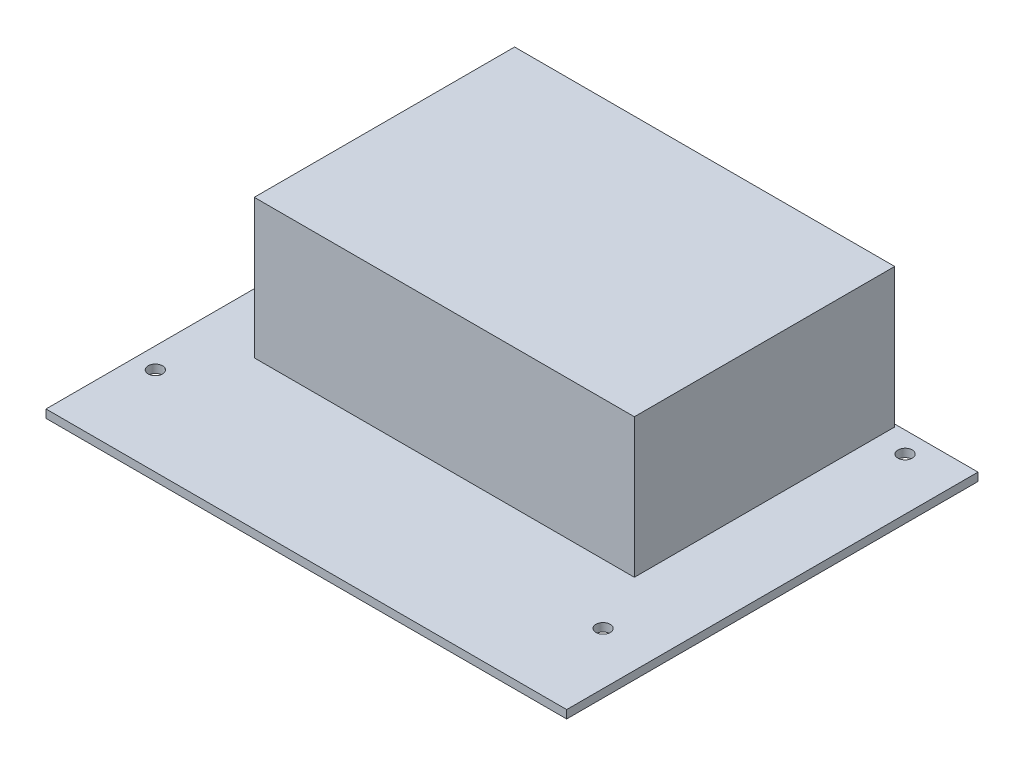
ISO-10303-21;
HEADER;
FILE_DESCRIPTION(('STEP AP214'),'2;1');
FILE_NAME('part.step','',(''),(''),'','','');
FILE_SCHEMA(('AUTOMOTIVE_DESIGN { 1 0 10303 214 1 1 1 1 }'));
ENDSEC;
DATA;
#1=APPLICATION_CONTEXT('core data for automotive mechanical design processes');
#2=APPLICATION_PROTOCOL_DEFINITION('international standard','automotive_design',2000,#1);
#3=PRODUCT_CONTEXT('',#1,'mechanical');
#4=PRODUCT('Part','Part','',(#3));
#5=PRODUCT_RELATED_PRODUCT_CATEGORY('part','',(#4));
#6=PRODUCT_DEFINITION_FORMATION('','',#4);
#7=PRODUCT_DEFINITION_CONTEXT('part definition',#1,'design');
#8=PRODUCT_DEFINITION('design','',#6,#7);
#9=PRODUCT_DEFINITION_SHAPE('','',#8);
#10=(LENGTH_UNIT() NAMED_UNIT(*) SI_UNIT(.MILLI.,.METRE.));
#11=(NAMED_UNIT(*) PLANE_ANGLE_UNIT() SI_UNIT($,.RADIAN.));
#12=(NAMED_UNIT(*) SI_UNIT($,.STERADIAN.) SOLID_ANGLE_UNIT());
#13=UNCERTAINTY_MEASURE_WITH_UNIT(LENGTH_MEASURE(1.E-05),#10,'distance_accuracy_value','');
#14=(GEOMETRIC_REPRESENTATION_CONTEXT(3) GLOBAL_UNCERTAINTY_ASSIGNED_CONTEXT((#13)) GLOBAL_UNIT_ASSIGNED_CONTEXT((#10,
#11,#12)) REPRESENTATION_CONTEXT('',''));
#15=CARTESIAN_POINT('',(0.,0.,0.));
#16=DIRECTION('',(0.,0.,1.));
#17=DIRECTION('',(1.,0.,0.));
#18=AXIS2_PLACEMENT_3D('',#15,#16,#17);
#19=CARTESIAN_POINT('',(0.,1.57,0.));
#20=DIRECTION('',(0.,-1.,0.));
#21=DIRECTION('',(0.,0.,-1.));
#22=AXIS2_PLACEMENT_3D('',#19,#20,#21);
#23=PLANE('',#22);
#24=CARTESIAN_POINT('',(40.,1.57,22.5));
#25=DIRECTION('',(0.,1.,0.));
#26=DIRECTION('',(0.,0.,1.));
#27=AXIS2_PLACEMENT_3D('',#24,#25,#26);
#28=CIRCLE('',#27,1.375);
#29=CARTESIAN_POINT('',(40.,1.57,23.875));
#30=VERTEX_POINT('',#29);
#31=EDGE_CURVE('E124',#30,#30,#28,.T.);
#32=ORIENTED_EDGE('',*,*,#31,.F.);
#33=EDGE_LOOP('',(#32));
#34=FACE_BOUND('',#33,.T.);
#35=CARTESIAN_POINT('',(-46.,1.57,22.5));
#36=DIRECTION('',(0.,1.,0.));
#37=DIRECTION('',(0.,0.,1.));
#38=AXIS2_PLACEMENT_3D('',#35,#36,#37);
#39=CIRCLE('',#38,1.375);
#40=CARTESIAN_POINT('',(-46.,1.57,23.875));
#41=VERTEX_POINT('',#40);
#42=EDGE_CURVE('E133',#41,#41,#39,.T.);
#43=ORIENTED_EDGE('',*,*,#42,.F.);
#44=EDGE_LOOP('',(#43));
#45=FACE_BOUND('',#44,.T.);
#46=CARTESIAN_POINT('',(40.,1.57,-35.5));
#47=DIRECTION('',(0.,1.,0.));
#48=DIRECTION('',(0.,0.,1.));
#49=AXIS2_PLACEMENT_3D('',#46,#47,#48);
#50=CIRCLE('',#49,1.375);
#51=CARTESIAN_POINT('',(40.,1.57,-34.125));
#52=VERTEX_POINT('',#51);
#53=EDGE_CURVE('E139',#52,#52,#50,.T.);
#54=ORIENTED_EDGE('',*,*,#53,.F.);
#55=EDGE_LOOP('',(#54));
#56=FACE_BOUND('',#55,.T.);
#57=CARTESIAN_POINT('',(-46.,1.57,-35.5));
#58=DIRECTION('',(0.,1.,0.));
#59=DIRECTION('',(0.,0.,1.));
#60=AXIS2_PLACEMENT_3D('',#57,#58,#59);
#61=CIRCLE('',#60,1.375);
#62=CARTESIAN_POINT('',(-46.,1.57,-34.125));
#63=VERTEX_POINT('',#62);
#64=EDGE_CURVE('E145',#63,#63,#61,.T.);
#65=ORIENTED_EDGE('',*,*,#64,.F.);
#66=EDGE_LOOP('',(#65));
#67=FACE_BOUND('',#66,.T.);
#68=DIRECTION('',(0.,0.,-1.));
#69=VECTOR('',#68,1.);
#70=CARTESIAN_POINT('',(50.,1.57,39.5));
#71=LINE('',#70,#69);
#72=CARTESIAN_POINT('',(50.,1.57,39.5));
#73=VERTEX_POINT('',#72);
#74=CARTESIAN_POINT('',(50.,1.57,-39.5));
#75=VERTEX_POINT('',#74);
#76=EDGE_CURVE('E151',#73,#75,#71,.T.);
#77=ORIENTED_EDGE('',*,*,#76,.T.);
#78=DIRECTION('',(-1.,0.,0.));
#79=VECTOR('',#78,1.);
#80=CARTESIAN_POINT('',(-50.,1.57,-39.5));
#81=LINE('',#80,#79);
#82=CARTESIAN_POINT('',(-50.,1.57,-39.5));
#83=VERTEX_POINT('',#82);
#84=EDGE_CURVE('E154',#75,#83,#81,.T.);
#85=ORIENTED_EDGE('',*,*,#84,.T.);
#86=DIRECTION('',(0.,0.,1.));
#87=VECTOR('',#86,1.);
#88=CARTESIAN_POINT('',(-50.,1.57,39.5));
#89=LINE('',#88,#87);
#90=CARTESIAN_POINT('',(-50.,1.57,39.5));
#91=VERTEX_POINT('',#90);
#92=EDGE_CURVE('E157',#83,#91,#89,.T.);
#93=ORIENTED_EDGE('',*,*,#92,.T.);
#94=DIRECTION('',(1.,0.,0.));
#95=VECTOR('',#94,1.);
#96=CARTESIAN_POINT('',(-50.,1.57,39.5));
#97=LINE('',#96,#95);
#98=EDGE_CURVE('E159',#91,#73,#97,.T.);
#99=ORIENTED_EDGE('',*,*,#98,.T.);
#100=EDGE_LOOP('',(#77,#85,#93,#99));
#101=FACE_BOUND('',#100,.T.);
#102=DIRECTION('',(0.,0.,-1.));
#103=VECTOR('',#102,1.);
#104=CARTESIAN_POINT('',(34.5,1.57,11.));
#105=LINE('',#104,#103);
#106=CARTESIAN_POINT('',(34.5,1.57,11.));
#107=VERTEX_POINT('',#106);
#108=CARTESIAN_POINT('',(34.5,1.57,-39.));
#109=VERTEX_POINT('',#108);
#110=EDGE_CURVE('E51',#107,#109,#105,.T.);
#111=ORIENTED_EDGE('',*,*,#110,.F.);
#112=DIRECTION('',(1.,0.,0.));
#113=VECTOR('',#112,1.);
#114=CARTESIAN_POINT('',(-38.5,1.57,11.));
#115=LINE('',#114,#113);
#116=CARTESIAN_POINT('',(-38.5,1.57,11.));
#117=VERTEX_POINT('',#116);
#118=EDGE_CURVE('E55',#117,#107,#115,.T.);
#119=ORIENTED_EDGE('',*,*,#118,.F.);
#120=DIRECTION('',(0.,0.,1.));
#121=VECTOR('',#120,1.);
#122=CARTESIAN_POINT('',(-38.5,1.57,11.));
#123=LINE('',#122,#121);
#124=CARTESIAN_POINT('',(-38.5,1.57,-39.));
#125=VERTEX_POINT('',#124);
#126=EDGE_CURVE('E338',#125,#117,#123,.T.);
#127=ORIENTED_EDGE('',*,*,#126,.F.);
#128=DIRECTION('',(-1.,0.,0.));
#129=VECTOR('',#128,1.);
#130=CARTESIAN_POINT('',(-38.5,1.57,-39.));
#131=LINE('',#130,#129);
#132=EDGE_CURVE('E344',#109,#125,#131,.T.);
#133=ORIENTED_EDGE('',*,*,#132,.F.);
#134=EDGE_LOOP('',(#111,#119,#127,#133));
#135=FACE_BOUND('',#134,.T.);
#136=ADVANCED_FACE('F36',(#34,#45,#56,#67,#101,#135),#23,.F.);
#137=CARTESIAN_POINT('',(0.,0.,0.));
#138=DIRECTION('',(0.,-1.,0.));
#139=DIRECTION('',(0.,0.,-1.));
#140=AXIS2_PLACEMENT_3D('',#137,#138,#139);
#141=PLANE('',#140);
#142=CARTESIAN_POINT('',(-46.,0.,22.5));
#143=DIRECTION('',(0.,1.,0.));
#144=DIRECTION('',(0.,0.,1.));
#145=AXIS2_PLACEMENT_3D('',#142,#143,#144);
#146=CIRCLE('',#145,1.375);
#147=CARTESIAN_POINT('',(-46.,0.,23.875));
#148=VERTEX_POINT('',#147);
#149=EDGE_CURVE('E131',#148,#148,#146,.T.);
#150=ORIENTED_EDGE('',*,*,#149,.T.);
#151=EDGE_LOOP('',(#150));
#152=FACE_BOUND('',#151,.T.);
#153=CARTESIAN_POINT('',(-46.,0.,-35.5));
#154=DIRECTION('',(0.,1.,0.));
#155=DIRECTION('',(0.,0.,1.));
#156=AXIS2_PLACEMENT_3D('',#153,#154,#155);
#157=CIRCLE('',#156,1.375);
#158=CARTESIAN_POINT('',(-46.,0.,-34.125));
#159=VERTEX_POINT('',#158);
#160=EDGE_CURVE('E142',#159,#159,#157,.T.);
#161=ORIENTED_EDGE('',*,*,#160,.T.);
#162=EDGE_LOOP('',(#161));
#163=FACE_BOUND('',#162,.T.);
#164=DIRECTION('',(0.,0.,-1.));
#165=VECTOR('',#164,1.);
#166=CARTESIAN_POINT('',(50.,0.,39.5));
#167=LINE('',#166,#165);
#168=CARTESIAN_POINT('',(50.,0.,39.5));
#169=VERTEX_POINT('',#168);
#170=CARTESIAN_POINT('',(50.,0.,-39.5));
#171=VERTEX_POINT('',#170);
#172=EDGE_CURVE('E148',#169,#171,#167,.T.);
#173=ORIENTED_EDGE('',*,*,#172,.F.);
#174=DIRECTION('',(1.,0.,0.));
#175=VECTOR('',#174,1.);
#176=CARTESIAN_POINT('',(-50.,0.,39.5));
#177=LINE('',#176,#175);
#178=CARTESIAN_POINT('',(-50.,0.,39.5));
#179=VERTEX_POINT('',#178);
#180=EDGE_CURVE('E155',#179,#169,#177,.T.);
#181=ORIENTED_EDGE('',*,*,#180,.F.);
#182=DIRECTION('',(0.,0.,1.));
#183=VECTOR('',#182,1.);
#184=CARTESIAN_POINT('',(-50.,0.,39.5));
#185=LINE('',#184,#183);
#186=CARTESIAN_POINT('',(-50.,0.,-39.5));
#187=VERTEX_POINT('',#186);
#188=EDGE_CURVE('E166',#187,#179,#185,.T.);
#189=ORIENTED_EDGE('',*,*,#188,.F.);
#190=DIRECTION('',(-1.,0.,0.));
#191=VECTOR('',#190,1.);
#192=CARTESIAN_POINT('',(-50.,0.,-39.5));
#193=LINE('',#192,#191);
#194=EDGE_CURVE('E164',#171,#187,#193,.T.);
#195=ORIENTED_EDGE('',*,*,#194,.F.);
#196=EDGE_LOOP('',(#173,#181,#189,#195));
#197=FACE_BOUND('',#196,.T.);
#198=CARTESIAN_POINT('',(40.,0.,-35.5));
#199=DIRECTION('',(0.,1.,0.));
#200=DIRECTION('',(0.,0.,1.));
#201=AXIS2_PLACEMENT_3D('',#198,#199,#200);
#202=CIRCLE('',#201,1.375);
#203=CARTESIAN_POINT('',(40.,0.,-34.125));
#204=VERTEX_POINT('',#203);
#205=EDGE_CURVE('E136',#204,#204,#202,.T.);
#206=ORIENTED_EDGE('',*,*,#205,.T.);
#207=EDGE_LOOP('',(#206));
#208=FACE_BOUND('',#207,.T.);
#209=CARTESIAN_POINT('',(40.,0.,22.5));
#210=DIRECTION('',(0.,1.,0.));
#211=DIRECTION('',(0.,0.,1.));
#212=AXIS2_PLACEMENT_3D('',#209,#210,#211);
#213=CIRCLE('',#212,1.375);
#214=CARTESIAN_POINT('',(40.,0.,23.875));
#215=VERTEX_POINT('',#214);
#216=EDGE_CURVE('E121',#215,#215,#213,.T.);
#217=ORIENTED_EDGE('',*,*,#216,.T.);
#218=EDGE_LOOP('',(#217));
#219=FACE_BOUND('',#218,.T.);
#220=ADVANCED_FACE('F184',(#152,#163,#197,#208,#219),#141,.T.);
#221=CARTESIAN_POINT('',(50.,1.57,39.5));
#222=DIRECTION('',(-1.,0.,0.));
#223=DIRECTION('',(0.,0.,1.));
#224=AXIS2_PLACEMENT_3D('',#221,#222,#223);
#225=PLANE('',#224);
#226=ORIENTED_EDGE('',*,*,#172,.T.);
#227=DIRECTION('',(0.,-1.,0.));
#228=VECTOR('',#227,1.);
#229=CARTESIAN_POINT('',(50.,1.57,-39.5));
#230=LINE('',#229,#228);
#231=EDGE_CURVE('E11',#75,#171,#230,.T.);
#232=ORIENTED_EDGE('',*,*,#231,.F.);
#233=ORIENTED_EDGE('',*,*,#76,.F.);
#234=DIRECTION('',(0.,-1.,0.));
#235=VECTOR('',#234,1.);
#236=CARTESIAN_POINT('',(50.,1.57,39.5));
#237=LINE('',#236,#235);
#238=EDGE_CURVE('E161',#73,#169,#237,.T.);
#239=ORIENTED_EDGE('',*,*,#238,.T.);
#240=EDGE_LOOP('',(#226,#232,#233,#239));
#241=FACE_BOUND('',#240,.T.);
#242=ADVANCED_FACE('F38',(#241),#225,.F.);
#243=CARTESIAN_POINT('',(-50.,1.57,-39.5));
#244=DIRECTION('',(0.,0.,1.));
#245=DIRECTION('',(1.,0.,0.));
#246=AXIS2_PLACEMENT_3D('',#243,#244,#245);
#247=PLANE('',#246);
#248=ORIENTED_EDGE('',*,*,#194,.T.);
#249=DIRECTION('',(0.,-1.,0.));
#250=VECTOR('',#249,1.);
#251=CARTESIAN_POINT('',(-50.,1.57,-39.5));
#252=LINE('',#251,#250);
#253=EDGE_CURVE('E44',#83,#187,#252,.T.);
#254=ORIENTED_EDGE('',*,*,#253,.F.);
#255=ORIENTED_EDGE('',*,*,#84,.F.);
#256=ORIENTED_EDGE('',*,*,#231,.T.);
#257=EDGE_LOOP('',(#248,#254,#255,#256));
#258=FACE_BOUND('',#257,.T.);
#259=ADVANCED_FACE('F194',(#258),#247,.F.);
#260=CARTESIAN_POINT('',(-50.,1.57,39.5));
#261=DIRECTION('',(1.,0.,0.));
#262=DIRECTION('',(0.,0.,-1.));
#263=AXIS2_PLACEMENT_3D('',#260,#261,#262);
#264=PLANE('',#263);
#265=ORIENTED_EDGE('',*,*,#188,.T.);
#266=DIRECTION('',(0.,-1.,0.));
#267=VECTOR('',#266,1.);
#268=CARTESIAN_POINT('',(-50.,1.57,39.5));
#269=LINE('',#268,#267);
#270=EDGE_CURVE('E171',#91,#179,#269,.T.);
#271=ORIENTED_EDGE('',*,*,#270,.F.);
#272=ORIENTED_EDGE('',*,*,#92,.F.);
#273=ORIENTED_EDGE('',*,*,#253,.T.);
#274=EDGE_LOOP('',(#265,#271,#272,#273));
#275=FACE_BOUND('',#274,.T.);
#276=ADVANCED_FACE('F178',(#275),#264,.F.);
#277=CARTESIAN_POINT('',(-50.,1.57,39.5));
#278=DIRECTION('',(0.,0.,-1.));
#279=DIRECTION('',(-1.,0.,0.));
#280=AXIS2_PLACEMENT_3D('',#277,#278,#279);
#281=PLANE('',#280);
#282=ORIENTED_EDGE('',*,*,#180,.T.);
#283=ORIENTED_EDGE('',*,*,#238,.F.);
#284=ORIENTED_EDGE('',*,*,#98,.F.);
#285=ORIENTED_EDGE('',*,*,#270,.T.);
#286=EDGE_LOOP('',(#282,#283,#284,#285));
#287=FACE_BOUND('',#286,.T.);
#288=ADVANCED_FACE('F188',(#287),#281,.F.);
#289=CARTESIAN_POINT('',(-46.,1.57,-35.5));
#290=DIRECTION('',(0.,-1.,0.));
#291=DIRECTION('',(0.,0.,-1.));
#292=AXIS2_PLACEMENT_3D('',#289,#290,#291);
#293=CYLINDRICAL_SURFACE('',#292,1.375);
#294=ORIENTED_EDGE('',*,*,#64,.T.);
#295=EDGE_LOOP('',(#294));
#296=FACE_BOUND('',#295,.T.);
#297=ORIENTED_EDGE('',*,*,#160,.F.);
#298=EDGE_LOOP('',(#297));
#299=FACE_BOUND('',#298,.T.);
#300=ADVANCED_FACE('F212',(#296,#299),#293,.F.);
#301=CARTESIAN_POINT('',(40.,1.57,-35.5));
#302=DIRECTION('',(0.,-1.,0.));
#303=DIRECTION('',(0.,0.,-1.));
#304=AXIS2_PLACEMENT_3D('',#301,#302,#303);
#305=CYLINDRICAL_SURFACE('',#304,1.375);
#306=ORIENTED_EDGE('',*,*,#53,.T.);
#307=EDGE_LOOP('',(#306));
#308=FACE_BOUND('',#307,.T.);
#309=ORIENTED_EDGE('',*,*,#205,.F.);
#310=EDGE_LOOP('',(#309));
#311=FACE_BOUND('',#310,.T.);
#312=ADVANCED_FACE('F219',(#308,#311),#305,.F.);
#313=CARTESIAN_POINT('',(-46.,1.57,22.5));
#314=DIRECTION('',(0.,-1.,0.));
#315=DIRECTION('',(0.,0.,-1.));
#316=AXIS2_PLACEMENT_3D('',#313,#314,#315);
#317=CYLINDRICAL_SURFACE('',#316,1.375);
#318=ORIENTED_EDGE('',*,*,#42,.T.);
#319=EDGE_LOOP('',(#318));
#320=FACE_BOUND('',#319,.T.);
#321=ORIENTED_EDGE('',*,*,#149,.F.);
#322=EDGE_LOOP('',(#321));
#323=FACE_BOUND('',#322,.T.);
#324=ADVANCED_FACE('F224',(#320,#323),#317,.F.);
#325=CARTESIAN_POINT('',(40.,1.57,22.5));
#326=DIRECTION('',(0.,-1.,0.));
#327=DIRECTION('',(0.,0.,-1.));
#328=AXIS2_PLACEMENT_3D('',#325,#326,#327);
#329=CYLINDRICAL_SURFACE('',#328,1.375);
#330=ORIENTED_EDGE('',*,*,#31,.T.);
#331=EDGE_LOOP('',(#330));
#332=FACE_BOUND('',#331,.T.);
#333=ORIENTED_EDGE('',*,*,#216,.F.);
#334=EDGE_LOOP('',(#333));
#335=FACE_BOUND('',#334,.T.);
#336=ADVANCED_FACE('F234',(#332,#335),#329,.F.);
#337=CARTESIAN_POINT('',(34.5,28.276,11.));
#338=DIRECTION('',(-1.,0.,0.));
#339=DIRECTION('',(0.,0.,1.));
#340=AXIS2_PLACEMENT_3D('',#337,#338,#339);
#341=PLANE('',#340);
#342=ORIENTED_EDGE('',*,*,#110,.T.);
#343=DIRECTION('',(0.,-1.,0.));
#344=VECTOR('',#343,1.);
#345=CARTESIAN_POINT('',(34.5,28.276,-39.));
#346=LINE('',#345,#344);
#347=CARTESIAN_POINT('',(34.5,28.276,-39.));
#348=VERTEX_POINT('',#347);
#349=EDGE_CURVE('E104',#348,#109,#346,.T.);
#350=ORIENTED_EDGE('',*,*,#349,.F.);
#351=DIRECTION('',(0.,0.,-1.));
#352=VECTOR('',#351,1.);
#353=CARTESIAN_POINT('',(34.5,28.276,11.));
#354=LINE('',#353,#352);
#355=CARTESIAN_POINT('',(34.5,28.276,11.));
#356=VERTEX_POINT('',#355);
#357=EDGE_CURVE('E110',#356,#348,#354,.T.);
#358=ORIENTED_EDGE('',*,*,#357,.F.);
#359=DIRECTION('',(0.,-1.,0.));
#360=VECTOR('',#359,1.);
#361=CARTESIAN_POINT('',(34.5,28.276,11.));
#362=LINE('',#361,#360);
#363=EDGE_CURVE('E336',#356,#107,#362,.T.);
#364=ORIENTED_EDGE('',*,*,#363,.T.);
#365=EDGE_LOOP('',(#342,#350,#358,#364));
#366=FACE_BOUND('',#365,.T.);
#367=ADVANCED_FACE('F120',(#366),#341,.F.);
#368=CARTESIAN_POINT('',(-38.5,28.276,-39.));
#369=DIRECTION('',(0.,0.,1.));
#370=DIRECTION('',(1.,0.,0.));
#371=AXIS2_PLACEMENT_3D('',#368,#369,#370);
#372=PLANE('',#371);
#373=ORIENTED_EDGE('',*,*,#132,.T.);
#374=DIRECTION('',(0.,-1.,0.));
#375=VECTOR('',#374,1.);
#376=CARTESIAN_POINT('',(-38.5,28.276,-39.));
#377=LINE('',#376,#375);
#378=CARTESIAN_POINT('',(-38.5,28.276,-39.));
#379=VERTEX_POINT('',#378);
#380=EDGE_CURVE('E106',#379,#125,#377,.T.);
#381=ORIENTED_EDGE('',*,*,#380,.F.);
#382=DIRECTION('',(-1.,0.,0.));
#383=VECTOR('',#382,1.);
#384=CARTESIAN_POINT('',(-38.5,28.276,-39.));
#385=LINE('',#384,#383);
#386=EDGE_CURVE('E99',#348,#379,#385,.T.);
#387=ORIENTED_EDGE('',*,*,#386,.F.);
#388=ORIENTED_EDGE('',*,*,#349,.T.);
#389=EDGE_LOOP('',(#373,#381,#387,#388));
#390=FACE_BOUND('',#389,.T.);
#391=ADVANCED_FACE('F102',(#390),#372,.F.);
#392=CARTESIAN_POINT('',(-38.5,28.276,11.));
#393=DIRECTION('',(1.,0.,0.));
#394=DIRECTION('',(0.,0.,-1.));
#395=AXIS2_PLACEMENT_3D('',#392,#393,#394);
#396=PLANE('',#395);
#397=ORIENTED_EDGE('',*,*,#126,.T.);
#398=DIRECTION('',(0.,-1.,0.));
#399=VECTOR('',#398,1.);
#400=CARTESIAN_POINT('',(-38.5,28.276,11.));
#401=LINE('',#400,#399);
#402=CARTESIAN_POINT('',(-38.5,28.276,11.));
#403=VERTEX_POINT('',#402);
#404=EDGE_CURVE('E126',#403,#117,#401,.T.);
#405=ORIENTED_EDGE('',*,*,#404,.F.);
#406=DIRECTION('',(0.,0.,1.));
#407=VECTOR('',#406,1.);
#408=CARTESIAN_POINT('',(-38.5,28.276,11.));
#409=LINE('',#408,#407);
#410=EDGE_CURVE('E109',#379,#403,#409,.T.);
#411=ORIENTED_EDGE('',*,*,#410,.F.);
#412=ORIENTED_EDGE('',*,*,#380,.T.);
#413=EDGE_LOOP('',(#397,#405,#411,#412));
#414=FACE_BOUND('',#413,.T.);
#415=ADVANCED_FACE('F246',(#414),#396,.F.);
#416=CARTESIAN_POINT('',(-38.5,28.276,11.));
#417=DIRECTION('',(0.,0.,-1.));
#418=DIRECTION('',(-1.,0.,0.));
#419=AXIS2_PLACEMENT_3D('',#416,#417,#418);
#420=PLANE('',#419);
#421=ORIENTED_EDGE('',*,*,#118,.T.);
#422=ORIENTED_EDGE('',*,*,#363,.F.);
#423=DIRECTION('',(1.,0.,0.));
#424=VECTOR('',#423,1.);
#425=CARTESIAN_POINT('',(-38.5,28.276,11.));
#426=LINE('',#425,#424);
#427=EDGE_CURVE('E115',#403,#356,#426,.T.);
#428=ORIENTED_EDGE('',*,*,#427,.F.);
#429=ORIENTED_EDGE('',*,*,#404,.T.);
#430=EDGE_LOOP('',(#421,#422,#428,#429));
#431=FACE_BOUND('',#430,.T.);
#432=ADVANCED_FACE('F249',(#431),#420,.F.);
#433=CARTESIAN_POINT('',(0.,28.276,0.));
#434=DIRECTION('',(0.,-1.,0.));
#435=DIRECTION('',(0.,0.,-1.));
#436=AXIS2_PLACEMENT_3D('',#433,#434,#435);
#437=PLANE('',#436);
#438=ORIENTED_EDGE('',*,*,#357,.T.);
#439=ORIENTED_EDGE('',*,*,#386,.T.);
#440=ORIENTED_EDGE('',*,*,#410,.T.);
#441=ORIENTED_EDGE('',*,*,#427,.T.);
#442=EDGE_LOOP('',(#438,#439,#440,#441));
#443=FACE_BOUND('',#442,.T.);
#444=ADVANCED_FACE('F113',(#443),#437,.F.);
#445=CLOSED_SHELL('',(#136,#220,#242,#259,#276,#288,#300,#312,#324,#336,#367,#391,#415,#432,#444));
#446=MANIFOLD_SOLID_BREP('B2',#445);
#447=ADVANCED_BREP_SHAPE_REPRESENTATION('',(#18,#446),#14);
#448=SHAPE_DEFINITION_REPRESENTATION(#9,#447);
ENDSEC;
END-ISO-10303-21;
